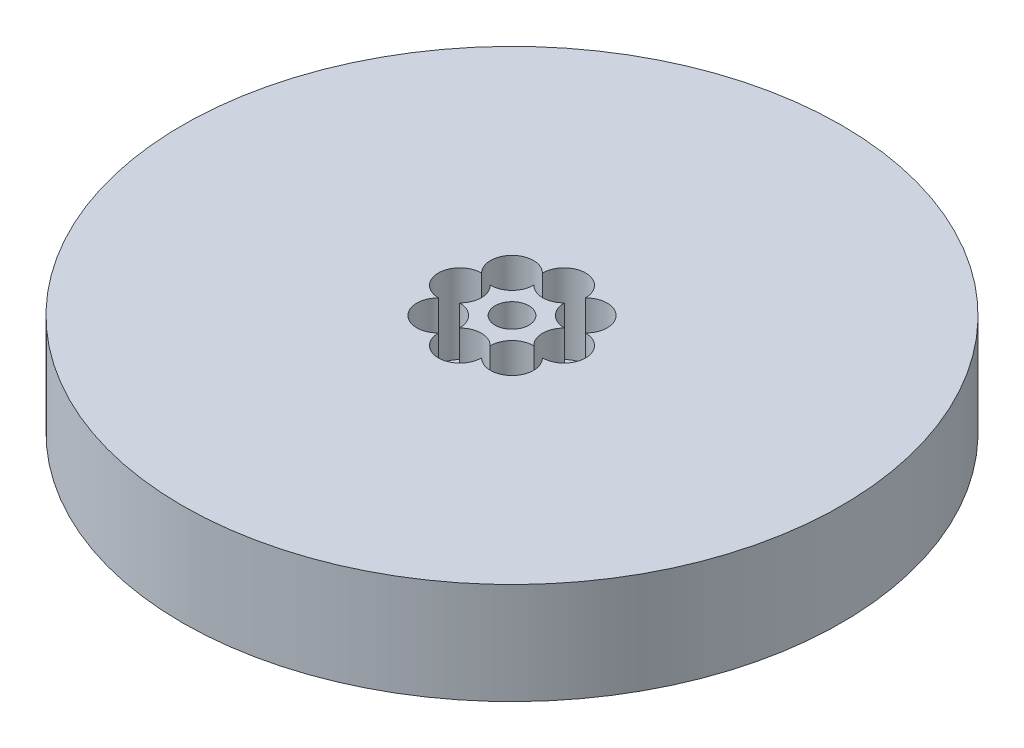
ISO-10303-21;
HEADER;
FILE_DESCRIPTION(('STEP AP214'),'2;1');
FILE_NAME('part.step','',(''),(''),'','','');
FILE_SCHEMA(('AUTOMOTIVE_DESIGN { 1 0 10303 214 1 1 1 1 }'));
ENDSEC;
DATA;
#1=APPLICATION_CONTEXT('core data for automotive mechanical design processes');
#2=APPLICATION_PROTOCOL_DEFINITION('international standard','automotive_design',2000,#1);
#3=PRODUCT_CONTEXT('',#1,'mechanical');
#4=PRODUCT('Part','Part','',(#3));
#5=PRODUCT_RELATED_PRODUCT_CATEGORY('part','',(#4));
#6=PRODUCT_DEFINITION_FORMATION('','',#4);
#7=PRODUCT_DEFINITION_CONTEXT('part definition',#1,'design');
#8=PRODUCT_DEFINITION('design','',#6,#7);
#9=PRODUCT_DEFINITION_SHAPE('','',#8);
#10=(LENGTH_UNIT() NAMED_UNIT(*) SI_UNIT(.MILLI.,.METRE.));
#11=(NAMED_UNIT(*) PLANE_ANGLE_UNIT() SI_UNIT($,.RADIAN.));
#12=(NAMED_UNIT(*) SI_UNIT($,.STERADIAN.) SOLID_ANGLE_UNIT());
#13=UNCERTAINTY_MEASURE_WITH_UNIT(LENGTH_MEASURE(1.E-05),#10,'distance_accuracy_value','');
#14=(GEOMETRIC_REPRESENTATION_CONTEXT(3) GLOBAL_UNCERTAINTY_ASSIGNED_CONTEXT((#13)) GLOBAL_UNIT_ASSIGNED_CONTEXT((#10,
#11,#12)) REPRESENTATION_CONTEXT('',''));
#15=CARTESIAN_POINT('',(0.,0.,0.));
#16=DIRECTION('',(0.,0.,1.));
#17=DIRECTION('',(1.,0.,0.));
#18=AXIS2_PLACEMENT_3D('',#15,#16,#17);
#19=CARTESIAN_POINT('',(0.,30.,0.));
#20=DIRECTION('',(0.,1.,0.));
#21=DIRECTION('',(0.,0.,1.));
#22=AXIS2_PLACEMENT_3D('',#19,#20,#21);
#23=PLANE('',#22);
#24=CARTESIAN_POINT('',(-10.9077660025007,30.,10.9077660025007));
#25=DIRECTION('',(0.,1.,0.));
#26=DIRECTION('',(0.707106781186549,0.,0.707106781186546));
#27=AXIS2_PLACEMENT_3D('',#24,#25,#26);
#28=CIRCLE('',#27,6.35771121553051);
#29=CARTESIAN_POINT('',(-4.55053572453053,30.,10.985965062225));
#30=VERTEX_POINT('',#29);
#31=CARTESIAN_POINT('',(-10.9859650622249,30.,4.55053572453057));
#32=VERTEX_POINT('',#31);
#33=EDGE_CURVE('E248',#30,#32,#28,.T.);
#34=ORIENTED_EDGE('',*,*,#33,.F.);
#35=CARTESIAN_POINT('',(0.,30.,15.4259106159287));
#36=DIRECTION('',(0.,1.,0.));
#37=DIRECTION('',(1.,0.,0.));
#38=AXIS2_PLACEMENT_3D('',#35,#36,#37);
#39=CIRCLE('',#38,6.35771121553051);
#40=CARTESIAN_POINT('',(4.55053572453061,30.,10.9859650622249));
#41=VERTEX_POINT('',#40);
#42=EDGE_CURVE('E230',#41,#30,#39,.T.);
#43=ORIENTED_EDGE('',*,*,#42,.F.);
#44=CARTESIAN_POINT('',(10.9077660025008,30.,10.9077660025007));
#45=DIRECTION('',(0.,1.,0.));
#46=DIRECTION('',(0.707106781186544,0.,-0.707106781186551));
#47=AXIS2_PLACEMENT_3D('',#44,#45,#46);
#48=CIRCLE('',#47,6.35771121553051);
#49=CARTESIAN_POINT('',(10.9859650622249,30.,4.55053572453049));
#50=VERTEX_POINT('',#49);
#51=EDGE_CURVE('E204',#50,#41,#48,.T.);
#52=ORIENTED_EDGE('',*,*,#51,.F.);
#53=CARTESIAN_POINT('',(15.4259106159287,30.,0.));
#54=DIRECTION('',(0.,1.,0.));
#55=DIRECTION('',(0.,0.,-1.));
#56=AXIS2_PLACEMENT_3D('',#53,#54,#55);
#57=CIRCLE('',#56,6.35771121553051);
#58=CARTESIAN_POINT('',(10.985965062225,30.,-4.55053572453065));
#59=VERTEX_POINT('',#58);
#60=EDGE_CURVE('E206',#59,#50,#57,.T.);
#61=ORIENTED_EDGE('',*,*,#60,.F.);
#62=CARTESIAN_POINT('',(10.9077660025006,30.,-10.9077660025008));
#63=DIRECTION('',(0.,1.,0.));
#64=DIRECTION('',(-0.707106781186554,0.,-0.707106781186541));
#65=AXIS2_PLACEMENT_3D('',#62,#63,#64);
#66=CIRCLE('',#65,6.35771121553051);
#67=CARTESIAN_POINT('',(4.55053572453045,30.,-10.985965062225));
#68=VERTEX_POINT('',#67);
#69=EDGE_CURVE('E186',#68,#59,#66,.T.);
#70=ORIENTED_EDGE('',*,*,#69,.F.);
#71=CARTESIAN_POINT('',(-1.61577837150531E-13,30.,-15.4259106159287));
#72=DIRECTION('',(0.,1.,0.));
#73=DIRECTION('',(-1.,0.,0.));
#74=AXIS2_PLACEMENT_3D('',#71,#72,#73);
#75=CIRCLE('',#74,6.35771121553051);
#76=CARTESIAN_POINT('',(-4.55053572453068,30.,-10.9859650622249));
#77=VERTEX_POINT('',#76);
#78=EDGE_CURVE('E163',#77,#68,#75,.T.);
#79=ORIENTED_EDGE('',*,*,#78,.F.);
#80=CARTESIAN_POINT('',(-10.9077660025009,30.,-10.9077660025006));
#81=DIRECTION('',(0.,1.,0.));
#82=DIRECTION('',(-0.707106781186539,0.,0.707106781186556));
#83=AXIS2_PLACEMENT_3D('',#80,#81,#82);
#84=CIRCLE('',#83,6.35771121553051);
#85=CARTESIAN_POINT('',(-10.9859650622248,30.,-4.55053572453041));
#86=VERTEX_POINT('',#85);
#87=EDGE_CURVE('E182',#86,#77,#84,.T.);
#88=ORIENTED_EDGE('',*,*,#87,.F.);
#89=CARTESIAN_POINT('',(-15.4259106159287,30.,0.));
#90=DIRECTION('',(0.,1.,0.));
#91=DIRECTION('',(0.,0.,1.));
#92=AXIS2_PLACEMENT_3D('',#89,#90,#91);
#93=CIRCLE('',#92,6.35771121553051);
#94=EDGE_CURVE('E261',#32,#86,#93,.T.);
#95=ORIENTED_EDGE('',*,*,#94,.F.);
#96=EDGE_LOOP('',(#34,#43,#52,#61,#70,#79,#88,#95));
#97=FACE_BOUND('',#96,.T.);
#98=CARTESIAN_POINT('',(0.,30.,0.));
#99=DIRECTION('',(0.,1.,0.));
#100=DIRECTION('',(0.,0.,1.));
#101=AXIS2_PLACEMENT_3D('',#98,#99,#100);
#102=CIRCLE('',#101,5.);
#103=CARTESIAN_POINT('',(0.,30.,5.));
#104=VERTEX_POINT('',#103);
#105=EDGE_CURVE('E262',#104,#104,#102,.T.);
#106=ORIENTED_EDGE('',*,*,#105,.F.);
#107=EDGE_LOOP('',(#106));
#108=FACE_BOUND('',#107,.T.);
#109=ADVANCED_FACE('F39',(#97,#108),#23,.T.);
#110=CARTESIAN_POINT('',(-15.4259106159287,6.49466639699759,0.));
#111=DIRECTION('',(0.,1.,0.));
#112=DIRECTION('',(0.,0.,1.));
#113=AXIS2_PLACEMENT_3D('',#110,#111,#112);
#114=CYLINDRICAL_SURFACE('',#113,6.35771121553051);
#115=CARTESIAN_POINT('',(-15.4259106159287,6.49466639699759,0.));
#116=DIRECTION('',(0.,1.,0.));
#117=DIRECTION('',(0.,0.,1.));
#118=AXIS2_PLACEMENT_3D('',#115,#116,#117);
#119=CIRCLE('',#118,6.35771121553051);
#120=CARTESIAN_POINT('',(-10.9859650622249,6.49466639699759,4.55053572453057));
#121=VERTEX_POINT('',#120);
#122=CARTESIAN_POINT('',(-10.9859650622248,6.49466639699759,-4.55053572453041));
#123=VERTEX_POINT('',#122);
#124=EDGE_CURVE('E257',#121,#123,#119,.T.);
#125=ORIENTED_EDGE('',*,*,#124,.F.);
#126=DIRECTION('',(0.,1.,0.));
#127=VECTOR('',#126,1.);
#128=CARTESIAN_POINT('',(-10.9859650622249,18.2473331984988,4.55053572453057));
#129=LINE('',#128,#127);
#130=EDGE_CURVE('E255',#121,#32,#129,.T.);
#131=ORIENTED_EDGE('',*,*,#130,.T.);
#132=ORIENTED_EDGE('',*,*,#94,.T.);
#133=DIRECTION('',(0.,1.,0.));
#134=VECTOR('',#133,1.);
#135=CARTESIAN_POINT('',(-10.9859650622248,18.2473331984988,-4.55053572453041));
#136=LINE('',#135,#134);
#137=EDGE_CURVE('E250',#86,#123,#136,.F.);
#138=ORIENTED_EDGE('',*,*,#137,.T.);
#139=EDGE_LOOP('',(#125,#131,#132,#138));
#140=FACE_BOUND('',#139,.T.);
#141=ADVANCED_FACE('F277',(#140),#114,.F.);
#142=CARTESIAN_POINT('',(0.,30.,0.));
#143=DIRECTION('',(0.,-1.,0.));
#144=DIRECTION('',(0.,0.,-1.));
#145=AXIS2_PLACEMENT_3D('',#142,#143,#144);
#146=CYLINDRICAL_SURFACE('',#145,97.5);
#147=CARTESIAN_POINT('',(0.,30.,0.));
#148=DIRECTION('',(0.,1.,0.));
#149=DIRECTION('',(0.,0.,1.));
#150=AXIS2_PLACEMENT_3D('',#147,#148,#149);
#151=CIRCLE('',#150,97.5);
#152=CARTESIAN_POINT('',(0.,30.,97.5));
#153=VERTEX_POINT('',#152);
#154=EDGE_CURVE('E11',#153,#153,#151,.T.);
#155=ORIENTED_EDGE('',*,*,#154,.F.);
#156=EDGE_LOOP('',(#155));
#157=FACE_BOUND('',#156,.T.);
#158=CARTESIAN_POINT('',(0.,0.,0.));
#159=DIRECTION('',(0.,1.,0.));
#160=DIRECTION('',(0.,0.,1.));
#161=AXIS2_PLACEMENT_3D('',#158,#159,#160);
#162=CIRCLE('',#161,97.5);
#163=CARTESIAN_POINT('',(0.,0.,97.5));
#164=VERTEX_POINT('',#163);
#165=EDGE_CURVE('E43',#164,#164,#162,.T.);
#166=ORIENTED_EDGE('',*,*,#165,.T.);
#167=EDGE_LOOP('',(#166));
#168=FACE_BOUND('',#167,.T.);
#169=ADVANCED_FACE('F41',(#157,#168),#146,.T.);
#170=CARTESIAN_POINT('',(-15.3477115562044,30.,6.35723027797017));
#171=VERTEX_POINT('',#170);
#172=CARTESIAN_POINT('',(-6.35723027797012,30.,15.3477115562044));
#173=VERTEX_POINT('',#172);
#174=EDGE_CURVE('E242',#171,#173,#28,.T.);
#175=ORIENTED_EDGE('',*,*,#174,.F.);
#176=CARTESIAN_POINT('',(-15.3477115562047,30.,-6.35723027797017));
#177=VERTEX_POINT('',#176);
#178=EDGE_CURVE('E260',#177,#171,#93,.T.);
#179=ORIENTED_EDGE('',*,*,#178,.F.);
#180=CARTESIAN_POINT('',(-6.35723027797033,30.,-15.3477115562044));
#181=VERTEX_POINT('',#180);
#182=EDGE_CURVE('E178',#181,#177,#84,.T.);
#183=ORIENTED_EDGE('',*,*,#182,.F.);
#184=CARTESIAN_POINT('',(6.35723027797001,30.,-15.3477115562045));
#185=VERTEX_POINT('',#184);
#186=EDGE_CURVE('E168',#185,#181,#75,.T.);
#187=ORIENTED_EDGE('',*,*,#186,.F.);
#188=CARTESIAN_POINT('',(15.3477115562043,30.,-6.35723027797017));
#189=VERTEX_POINT('',#188);
#190=EDGE_CURVE('E195',#189,#185,#66,.T.);
#191=ORIENTED_EDGE('',*,*,#190,.F.);
#192=CARTESIAN_POINT('',(15.3477115562046,30.,6.35723027797017));
#193=VERTEX_POINT('',#192);
#194=EDGE_CURVE('E199',#193,#189,#57,.T.);
#195=ORIENTED_EDGE('',*,*,#194,.F.);
#196=CARTESIAN_POINT('',(6.35723027797022,30.,15.3477115562044));
#197=VERTEX_POINT('',#196);
#198=EDGE_CURVE('E213',#197,#193,#48,.T.);
#199=ORIENTED_EDGE('',*,*,#198,.F.);
#200=EDGE_CURVE('E222',#173,#197,#39,.T.);
#201=ORIENTED_EDGE('',*,*,#200,.F.);
#202=EDGE_LOOP('',(#175,#179,#183,#187,#191,#195,#199,#201));
#203=FACE_BOUND('',#202,.T.);
#204=ORIENTED_EDGE('',*,*,#154,.T.);
#205=EDGE_LOOP('',(#204));
#206=FACE_BOUND('',#205,.T.);
#207=ADVANCED_FACE('F319',(#203,#206),#23,.T.);
#208=CARTESIAN_POINT('',(0.,0.,0.));
#209=DIRECTION('',(0.,1.,0.));
#210=DIRECTION('',(0.,0.,1.));
#211=AXIS2_PLACEMENT_3D('',#208,#209,#210);
#212=PLANE('',#211);
#213=CARTESIAN_POINT('',(0.,0.,0.));
#214=DIRECTION('',(0.,1.,0.));
#215=DIRECTION('',(0.,0.,1.));
#216=AXIS2_PLACEMENT_3D('',#213,#214,#215);
#217=CIRCLE('',#216,5.);
#218=CARTESIAN_POINT('',(0.,0.,5.));
#219=VERTEX_POINT('',#218);
#220=EDGE_CURVE('E270',#219,#219,#217,.T.);
#221=ORIENTED_EDGE('',*,*,#220,.T.);
#222=EDGE_LOOP('',(#221));
#223=FACE_BOUND('',#222,.T.);
#224=ORIENTED_EDGE('',*,*,#165,.F.);
#225=EDGE_LOOP('',(#224));
#226=FACE_BOUND('',#225,.T.);
#227=ADVANCED_FACE('F327',(#223,#226),#212,.F.);
#228=CARTESIAN_POINT('',(0.,30.,0.));
#229=DIRECTION('',(0.,-1.,0.));
#230=DIRECTION('',(0.,0.,-1.));
#231=AXIS2_PLACEMENT_3D('',#228,#229,#230);
#232=CYLINDRICAL_SURFACE('',#231,5.);
#233=ORIENTED_EDGE('',*,*,#105,.T.);
#234=EDGE_LOOP('',(#233));
#235=FACE_BOUND('',#234,.T.);
#236=ORIENTED_EDGE('',*,*,#220,.F.);
#237=EDGE_LOOP('',(#236));
#238=FACE_BOUND('',#237,.T.);
#239=ADVANCED_FACE('F331',(#235,#238),#232,.F.);
#240=ORIENTED_EDGE('',*,*,#178,.T.);
#241=DIRECTION('',(0.,1.,0.));
#242=VECTOR('',#241,1.);
#243=CARTESIAN_POINT('',(-15.3477115562044,18.2473331984988,6.35723027797017));
#244=LINE('',#243,#242);
#245=CARTESIAN_POINT('',(-15.3477115562044,6.49466639699759,6.35723027797017));
#246=VERTEX_POINT('',#245);
#247=EDGE_CURVE('E65',#171,#246,#244,.F.);
#248=ORIENTED_EDGE('',*,*,#247,.T.);
#249=CARTESIAN_POINT('',(-15.3477115562047,6.49466639699759,-6.35723027797017));
#250=VERTEX_POINT('',#249);
#251=EDGE_CURVE('E256',#250,#246,#119,.T.);
#252=ORIENTED_EDGE('',*,*,#251,.F.);
#253=DIRECTION('',(0.,1.,0.));
#254=VECTOR('',#253,1.);
#255=CARTESIAN_POINT('',(-15.3477115562047,18.2473331984988,-6.35723027797017));
#256=LINE('',#255,#254);
#257=EDGE_CURVE('E180',#250,#177,#256,.T.);
#258=ORIENTED_EDGE('',*,*,#257,.T.);
#259=EDGE_LOOP('',(#240,#248,#252,#258));
#260=FACE_BOUND('',#259,.T.);
#261=ADVANCED_FACE('F312',(#260),#114,.F.);
#262=CARTESIAN_POINT('',(-15.4259106159287,6.49466639699759,0.));
#263=DIRECTION('',(0.,1.,0.));
#264=DIRECTION('',(0.,0.,1.));
#265=AXIS2_PLACEMENT_3D('',#262,#263,#264);
#266=PLANE('',#265);
#267=CARTESIAN_POINT('',(-10.9077660025007,6.49466639699759,10.9077660025007));
#268=DIRECTION('',(0.,1.,0.));
#269=DIRECTION('',(0.707106781186549,0.,0.707106781186546));
#270=AXIS2_PLACEMENT_3D('',#267,#268,#269);
#271=CIRCLE('',#270,6.35771121553051);
#272=CARTESIAN_POINT('',(-4.55053572453053,6.49466639699759,10.985965062225));
#273=VERTEX_POINT('',#272);
#274=EDGE_CURVE('E243',#273,#121,#271,.T.);
#275=ORIENTED_EDGE('',*,*,#274,.T.);
#276=ORIENTED_EDGE('',*,*,#124,.T.);
#277=CARTESIAN_POINT('',(-10.9077660025009,6.49466639699759,-10.9077660025006));
#278=DIRECTION('',(0.,1.,0.));
#279=DIRECTION('',(-0.707106781186539,0.,0.707106781186556));
#280=AXIS2_PLACEMENT_3D('',#277,#278,#279);
#281=CIRCLE('',#280,6.35771121553051);
#282=CARTESIAN_POINT('',(-4.55053572453068,6.49466639699759,-10.9859650622249));
#283=VERTEX_POINT('',#282);
#284=EDGE_CURVE('E53',#123,#283,#281,.T.);
#285=ORIENTED_EDGE('',*,*,#284,.T.);
#286=CARTESIAN_POINT('',(-1.61577837150531E-13,6.49466639699759,-15.4259106159287));
#287=DIRECTION('',(0.,1.,0.));
#288=DIRECTION('',(-1.,0.,0.));
#289=AXIS2_PLACEMENT_3D('',#286,#287,#288);
#290=CIRCLE('',#289,6.35771121553051);
#291=CARTESIAN_POINT('',(4.55053572453045,6.49466639699759,-10.985965062225));
#292=VERTEX_POINT('',#291);
#293=EDGE_CURVE('E162',#283,#292,#290,.T.);
#294=ORIENTED_EDGE('',*,*,#293,.T.);
#295=CARTESIAN_POINT('',(10.9077660025006,6.49466639699759,-10.9077660025008));
#296=DIRECTION('',(0.,1.,0.));
#297=DIRECTION('',(-0.707106781186554,0.,-0.707106781186541));
#298=AXIS2_PLACEMENT_3D('',#295,#296,#297);
#299=CIRCLE('',#298,6.35771121553051);
#300=CARTESIAN_POINT('',(10.985965062225,6.49466639699759,-4.55053572453065));
#301=VERTEX_POINT('',#300);
#302=EDGE_CURVE('E191',#292,#301,#299,.T.);
#303=ORIENTED_EDGE('',*,*,#302,.T.);
#304=CARTESIAN_POINT('',(15.4259106159287,6.49466639699759,0.));
#305=DIRECTION('',(0.,1.,0.));
#306=DIRECTION('',(0.,0.,-1.));
#307=AXIS2_PLACEMENT_3D('',#304,#305,#306);
#308=CIRCLE('',#307,6.35771121553051);
#309=CARTESIAN_POINT('',(10.9859650622249,6.49466639699759,4.55053572453049));
#310=VERTEX_POINT('',#309);
#311=EDGE_CURVE('E203',#301,#310,#308,.T.);
#312=ORIENTED_EDGE('',*,*,#311,.T.);
#313=CARTESIAN_POINT('',(10.9077660025008,6.49466639699759,10.9077660025007));
#314=DIRECTION('',(0.,1.,0.));
#315=DIRECTION('',(0.707106781186544,0.,-0.707106781186551));
#316=AXIS2_PLACEMENT_3D('',#313,#314,#315);
#317=CIRCLE('',#316,6.35771121553051);
#318=CARTESIAN_POINT('',(4.55053572453061,6.49466639699759,10.9859650622249));
#319=VERTEX_POINT('',#318);
#320=EDGE_CURVE('E215',#310,#319,#317,.T.);
#321=ORIENTED_EDGE('',*,*,#320,.T.);
#322=CARTESIAN_POINT('',(0.,6.49466639699759,15.4259106159287));
#323=DIRECTION('',(0.,1.,0.));
#324=DIRECTION('',(1.,0.,0.));
#325=AXIS2_PLACEMENT_3D('',#322,#323,#324);
#326=CIRCLE('',#325,6.35771121553051);
#327=EDGE_CURVE('E225',#319,#273,#326,.T.);
#328=ORIENTED_EDGE('',*,*,#327,.T.);
#329=EDGE_LOOP('',(#275,#276,#285,#294,#303,#312,#321,#328));
#330=FACE_BOUND('',#329,.T.);
#331=ORIENTED_EDGE('',*,*,#251,.T.);
#332=CARTESIAN_POINT('',(-6.35723027797012,6.49466639699759,15.3477115562044));
#333=VERTEX_POINT('',#332);
#334=EDGE_CURVE('E247',#246,#333,#271,.T.);
#335=ORIENTED_EDGE('',*,*,#334,.T.);
#336=CARTESIAN_POINT('',(6.35723027797022,6.49466639699759,15.3477115562044));
#337=VERTEX_POINT('',#336);
#338=EDGE_CURVE('E226',#333,#337,#326,.T.);
#339=ORIENTED_EDGE('',*,*,#338,.T.);
#340=CARTESIAN_POINT('',(15.3477115562046,6.49466639699759,6.35723027797017));
#341=VERTEX_POINT('',#340);
#342=EDGE_CURVE('E207',#337,#341,#317,.T.);
#343=ORIENTED_EDGE('',*,*,#342,.T.);
#344=CARTESIAN_POINT('',(15.3477115562043,6.49466639699759,-6.35723027797017));
#345=VERTEX_POINT('',#344);
#346=EDGE_CURVE('E202',#341,#345,#308,.T.);
#347=ORIENTED_EDGE('',*,*,#346,.T.);
#348=CARTESIAN_POINT('',(6.35723027797001,6.49466639699759,-15.3477115562045));
#349=VERTEX_POINT('',#348);
#350=EDGE_CURVE('E159',#345,#349,#299,.T.);
#351=ORIENTED_EDGE('',*,*,#350,.T.);
#352=CARTESIAN_POINT('',(-6.35723027797033,6.49466639699759,-15.3477115562044));
#353=VERTEX_POINT('',#352);
#354=EDGE_CURVE('E155',#349,#353,#290,.T.);
#355=ORIENTED_EDGE('',*,*,#354,.T.);
#356=EDGE_CURVE('E160',#353,#250,#281,.T.);
#357=ORIENTED_EDGE('',*,*,#356,.T.);
#358=EDGE_LOOP('',(#331,#335,#339,#343,#347,#351,#355,#357));
#359=FACE_BOUND('',#358,.T.);
#360=ADVANCED_FACE('F154',(#330,#359),#266,.T.);
#361=CARTESIAN_POINT('',(-10.9077660025007,6.49466639699759,10.9077660025007));
#362=DIRECTION('',(0.,1.,0.));
#363=DIRECTION('',(0.,0.,1.));
#364=AXIS2_PLACEMENT_3D('',#361,#362,#363);
#365=CYLINDRICAL_SURFACE('',#364,6.35771121553051);
#366=ORIENTED_EDGE('',*,*,#274,.F.);
#367=DIRECTION('',(0.,1.,0.));
#368=VECTOR('',#367,1.);
#369=CARTESIAN_POINT('',(-4.55053572453053,18.2473331984988,10.985965062225));
#370=LINE('',#369,#368);
#371=EDGE_CURVE('E241',#273,#30,#370,.T.);
#372=ORIENTED_EDGE('',*,*,#371,.T.);
#373=ORIENTED_EDGE('',*,*,#33,.T.);
#374=ORIENTED_EDGE('',*,*,#130,.F.);
#375=EDGE_LOOP('',(#366,#372,#373,#374));
#376=FACE_BOUND('',#375,.T.);
#377=ADVANCED_FACE('F307',(#376),#365,.F.);
#378=ORIENTED_EDGE('',*,*,#174,.T.);
#379=DIRECTION('',(0.,1.,0.));
#380=VECTOR('',#379,1.);
#381=CARTESIAN_POINT('',(-6.35723027797012,18.2473331984988,15.3477115562044));
#382=LINE('',#381,#380);
#383=EDGE_CURVE('E236',#173,#333,#382,.F.);
#384=ORIENTED_EDGE('',*,*,#383,.T.);
#385=ORIENTED_EDGE('',*,*,#334,.F.);
#386=ORIENTED_EDGE('',*,*,#247,.F.);
#387=EDGE_LOOP('',(#378,#384,#385,#386));
#388=FACE_BOUND('',#387,.T.);
#389=ADVANCED_FACE('F310',(#388),#365,.F.);
#390=CARTESIAN_POINT('',(-10.9077660025009,6.49466639699759,-10.9077660025006));
#391=DIRECTION('',(0.,1.,0.));
#392=DIRECTION('',(0.,0.,1.));
#393=AXIS2_PLACEMENT_3D('',#390,#391,#392);
#394=CYLINDRICAL_SURFACE('',#393,6.35771121553051);
#395=ORIENTED_EDGE('',*,*,#356,.F.);
#396=DIRECTION('',(0.,1.,0.));
#397=VECTOR('',#396,1.);
#398=CARTESIAN_POINT('',(-6.35723027797033,18.2473331984988,-15.3477115562044));
#399=LINE('',#398,#397);
#400=EDGE_CURVE('E170',#181,#353,#399,.F.);
#401=ORIENTED_EDGE('',*,*,#400,.F.);
#402=ORIENTED_EDGE('',*,*,#182,.T.);
#403=ORIENTED_EDGE('',*,*,#257,.F.);
#404=EDGE_LOOP('',(#395,#401,#402,#403));
#405=FACE_BOUND('',#404,.T.);
#406=ADVANCED_FACE('F174',(#405),#394,.F.);
#407=ORIENTED_EDGE('',*,*,#87,.T.);
#408=DIRECTION('',(0.,1.,0.));
#409=VECTOR('',#408,1.);
#410=CARTESIAN_POINT('',(-4.55053572453068,18.2473331984988,-10.9859650622249));
#411=LINE('',#410,#409);
#412=EDGE_CURVE('E172',#283,#77,#411,.T.);
#413=ORIENTED_EDGE('',*,*,#412,.F.);
#414=ORIENTED_EDGE('',*,*,#284,.F.);
#415=ORIENTED_EDGE('',*,*,#137,.F.);
#416=EDGE_LOOP('',(#407,#413,#414,#415));
#417=FACE_BOUND('',#416,.T.);
#418=ADVANCED_FACE('F278',(#417),#394,.F.);
#419=CARTESIAN_POINT('',(0.,6.49466639699759,15.4259106159287));
#420=DIRECTION('',(0.,1.,0.));
#421=DIRECTION('',(0.,0.,1.));
#422=AXIS2_PLACEMENT_3D('',#419,#420,#421);
#423=CYLINDRICAL_SURFACE('',#422,6.35771121553051);
#424=ORIENTED_EDGE('',*,*,#327,.F.);
#425=DIRECTION('',(0.,1.,0.));
#426=VECTOR('',#425,1.);
#427=CARTESIAN_POINT('',(4.55053572453061,18.2473331984988,10.9859650622249));
#428=LINE('',#427,#426);
#429=EDGE_CURVE('E217',#319,#41,#428,.T.);
#430=ORIENTED_EDGE('',*,*,#429,.T.);
#431=ORIENTED_EDGE('',*,*,#42,.T.);
#432=ORIENTED_EDGE('',*,*,#371,.F.);
#433=EDGE_LOOP('',(#424,#430,#431,#432));
#434=FACE_BOUND('',#433,.T.);
#435=ADVANCED_FACE('F303',(#434),#423,.F.);
#436=CARTESIAN_POINT('',(10.9077660025006,6.49466639699759,-10.9077660025008));
#437=DIRECTION('',(0.,1.,0.));
#438=DIRECTION('',(0.,0.,1.));
#439=AXIS2_PLACEMENT_3D('',#436,#437,#438);
#440=CYLINDRICAL_SURFACE('',#439,6.35771121553051);
#441=DIRECTION('',(0.,1.,0.));
#442=VECTOR('',#441,1.);
#443=CARTESIAN_POINT('',(4.55053572453045,18.2473331984988,-10.985965062225));
#444=LINE('',#443,#442);
#445=EDGE_CURVE('E237',#292,#68,#444,.T.);
#446=ORIENTED_EDGE('',*,*,#445,.T.);
#447=ORIENTED_EDGE('',*,*,#69,.T.);
#448=DIRECTION('',(0.,1.,0.));
#449=VECTOR('',#448,1.);
#450=CARTESIAN_POINT('',(10.985965062225,18.2473331984988,-4.55053572453065));
#451=LINE('',#450,#449);
#452=EDGE_CURVE('E197',#301,#59,#451,.T.);
#453=ORIENTED_EDGE('',*,*,#452,.F.);
#454=ORIENTED_EDGE('',*,*,#302,.F.);
#455=EDGE_LOOP('',(#446,#447,#453,#454));
#456=FACE_BOUND('',#455,.T.);
#457=ADVANCED_FACE('F294',(#456),#440,.F.);
#458=CARTESIAN_POINT('',(10.9077660025008,6.49466639699759,10.9077660025007));
#459=DIRECTION('',(0.,1.,0.));
#460=DIRECTION('',(0.,0.,1.));
#461=AXIS2_PLACEMENT_3D('',#458,#459,#460);
#462=CYLINDRICAL_SURFACE('',#461,6.35771121553051);
#463=DIRECTION('',(0.,1.,0.));
#464=VECTOR('',#463,1.);
#465=CARTESIAN_POINT('',(10.9859650622249,18.2473331984988,4.55053572453049));
#466=LINE('',#465,#464);
#467=EDGE_CURVE('E235',#310,#50,#466,.T.);
#468=ORIENTED_EDGE('',*,*,#467,.T.);
#469=ORIENTED_EDGE('',*,*,#51,.T.);
#470=ORIENTED_EDGE('',*,*,#429,.F.);
#471=ORIENTED_EDGE('',*,*,#320,.F.);
#472=EDGE_LOOP('',(#468,#469,#470,#471));
#473=FACE_BOUND('',#472,.T.);
#474=ADVANCED_FACE('F301',(#473),#462,.F.);
#475=ORIENTED_EDGE('',*,*,#200,.T.);
#476=DIRECTION('',(0.,1.,0.));
#477=VECTOR('',#476,1.);
#478=CARTESIAN_POINT('',(6.35723027797022,18.2473331984988,15.3477115562044));
#479=LINE('',#478,#477);
#480=EDGE_CURVE('E211',#197,#337,#479,.F.);
#481=ORIENTED_EDGE('',*,*,#480,.T.);
#482=ORIENTED_EDGE('',*,*,#338,.F.);
#483=ORIENTED_EDGE('',*,*,#383,.F.);
#484=EDGE_LOOP('',(#475,#481,#482,#483));
#485=FACE_BOUND('',#484,.T.);
#486=ADVANCED_FACE('F348',(#485),#423,.F.);
#487=DIRECTION('',(0.,1.,0.));
#488=VECTOR('',#487,1.);
#489=CARTESIAN_POINT('',(15.3477115562046,18.2473331984988,6.35723027797017));
#490=LINE('',#489,#488);
#491=EDGE_CURVE('E223',#193,#341,#490,.F.);
#492=ORIENTED_EDGE('',*,*,#491,.T.);
#493=ORIENTED_EDGE('',*,*,#342,.F.);
#494=ORIENTED_EDGE('',*,*,#480,.F.);
#495=ORIENTED_EDGE('',*,*,#198,.T.);
#496=EDGE_LOOP('',(#492,#493,#494,#495));
#497=FACE_BOUND('',#496,.T.);
#498=ADVANCED_FACE('F353',(#497),#462,.F.);
#499=CARTESIAN_POINT('',(15.4259106159287,6.49466639699759,0.));
#500=DIRECTION('',(0.,1.,0.));
#501=DIRECTION('',(0.,0.,1.));
#502=AXIS2_PLACEMENT_3D('',#499,#500,#501);
#503=CYLINDRICAL_SURFACE('',#502,6.35771121553051);
#504=ORIENTED_EDGE('',*,*,#311,.F.);
#505=ORIENTED_EDGE('',*,*,#452,.T.);
#506=ORIENTED_EDGE('',*,*,#60,.T.);
#507=ORIENTED_EDGE('',*,*,#467,.F.);
#508=EDGE_LOOP('',(#504,#505,#506,#507));
#509=FACE_BOUND('',#508,.T.);
#510=ADVANCED_FACE('F296',(#509),#503,.F.);
#511=ORIENTED_EDGE('',*,*,#194,.T.);
#512=DIRECTION('',(0.,1.,0.));
#513=VECTOR('',#512,1.);
#514=CARTESIAN_POINT('',(15.3477115562043,18.2473331984988,-6.35723027797017));
#515=LINE('',#514,#513);
#516=EDGE_CURVE('E189',#189,#345,#515,.F.);
#517=ORIENTED_EDGE('',*,*,#516,.T.);
#518=ORIENTED_EDGE('',*,*,#346,.F.);
#519=ORIENTED_EDGE('',*,*,#491,.F.);
#520=EDGE_LOOP('',(#511,#517,#518,#519));
#521=FACE_BOUND('',#520,.T.);
#522=ADVANCED_FACE('F357',(#521),#503,.F.);
#523=DIRECTION('',(0.,1.,0.));
#524=VECTOR('',#523,1.);
#525=CARTESIAN_POINT('',(6.35723027797001,18.2473331984988,-15.3477115562045));
#526=LINE('',#525,#524);
#527=EDGE_CURVE('E233',#185,#349,#526,.F.);
#528=ORIENTED_EDGE('',*,*,#527,.T.);
#529=ORIENTED_EDGE('',*,*,#350,.F.);
#530=ORIENTED_EDGE('',*,*,#516,.F.);
#531=ORIENTED_EDGE('',*,*,#190,.T.);
#532=EDGE_LOOP('',(#528,#529,#530,#531));
#533=FACE_BOUND('',#532,.T.);
#534=ADVANCED_FACE('F362',(#533),#440,.F.);
#535=CARTESIAN_POINT('',(-1.61577837150531E-13,6.49466639699759,-15.4259106159287));
#536=DIRECTION('',(0.,1.,0.));
#537=DIRECTION('',(0.,0.,1.));
#538=AXIS2_PLACEMENT_3D('',#535,#536,#537);
#539=CYLINDRICAL_SURFACE('',#538,6.35771121553051);
#540=ORIENTED_EDGE('',*,*,#293,.F.);
#541=ORIENTED_EDGE('',*,*,#412,.T.);
#542=ORIENTED_EDGE('',*,*,#78,.T.);
#543=ORIENTED_EDGE('',*,*,#445,.F.);
#544=EDGE_LOOP('',(#540,#541,#542,#543));
#545=FACE_BOUND('',#544,.T.);
#546=ADVANCED_FACE('F288',(#545),#539,.F.);
#547=ORIENTED_EDGE('',*,*,#186,.T.);
#548=ORIENTED_EDGE('',*,*,#400,.T.);
#549=ORIENTED_EDGE('',*,*,#354,.F.);
#550=ORIENTED_EDGE('',*,*,#527,.F.);
#551=EDGE_LOOP('',(#547,#548,#549,#550));
#552=FACE_BOUND('',#551,.T.);
#553=ADVANCED_FACE('F169',(#552),#539,.F.);
#554=CLOSED_SHELL('',(#109,#141,#169,#207,#227,#239,#261,#360,#377,#389,#406,#418,#435,#457,
#474,#486,#498,#510,#522,#534,#546,#553));
#555=MANIFOLD_SOLID_BREP('B2',#554);
#556=ADVANCED_BREP_SHAPE_REPRESENTATION('',(#18,#555),#14);
#557=SHAPE_DEFINITION_REPRESENTATION(#9,#556);
ENDSEC;
END-ISO-10303-21;
